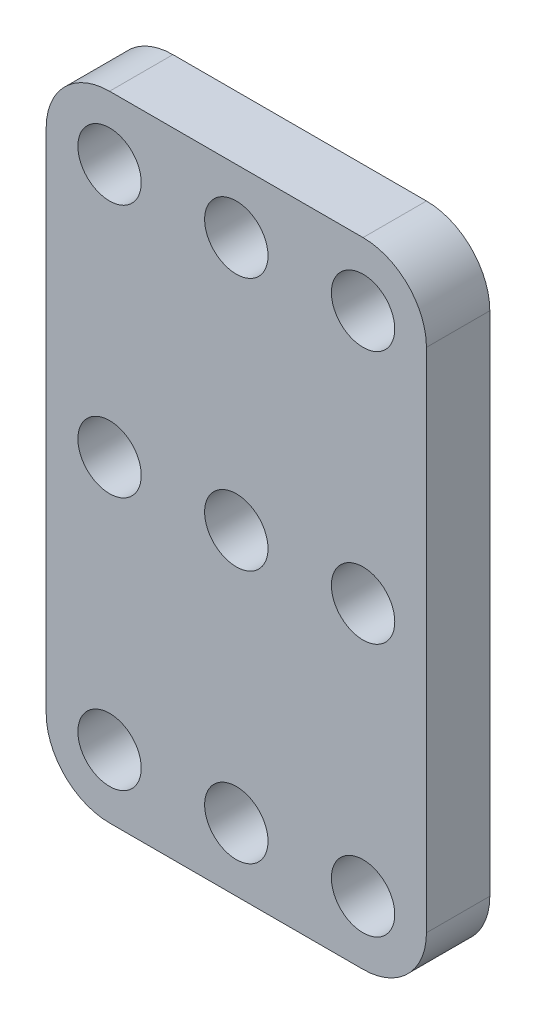
ISO-10303-21;
HEADER;
FILE_DESCRIPTION(('STEP AP214'),'2;1');
FILE_NAME('part.step','',(''),(''),'','','');
FILE_SCHEMA(('AUTOMOTIVE_DESIGN { 1 0 10303 214 1 1 1 1 }'));
ENDSEC;
DATA;
#1=APPLICATION_CONTEXT('core data for automotive mechanical design processes');
#2=APPLICATION_PROTOCOL_DEFINITION('international standard','automotive_design',2000,#1);
#3=PRODUCT_CONTEXT('',#1,'mechanical');
#4=PRODUCT('Part','Part','',(#3));
#5=PRODUCT_RELATED_PRODUCT_CATEGORY('part','',(#4));
#6=PRODUCT_DEFINITION_FORMATION('','',#4);
#7=PRODUCT_DEFINITION_CONTEXT('part definition',#1,'design');
#8=PRODUCT_DEFINITION('design','',#6,#7);
#9=PRODUCT_DEFINITION_SHAPE('','',#8);
#10=(LENGTH_UNIT() NAMED_UNIT(*) SI_UNIT(.MILLI.,.METRE.));
#11=(NAMED_UNIT(*) PLANE_ANGLE_UNIT() SI_UNIT($,.RADIAN.));
#12=(NAMED_UNIT(*) SI_UNIT($,.STERADIAN.) SOLID_ANGLE_UNIT());
#13=UNCERTAINTY_MEASURE_WITH_UNIT(LENGTH_MEASURE(1.E-05),#10,'distance_accuracy_value','');
#14=(GEOMETRIC_REPRESENTATION_CONTEXT(3) GLOBAL_UNCERTAINTY_ASSIGNED_CONTEXT((#13)) GLOBAL_UNIT_ASSIGNED_CONTEXT((#10,
#11,#12)) REPRESENTATION_CONTEXT('',''));
#15=CARTESIAN_POINT('',(0.,0.,0.));
#16=DIRECTION('',(0.,0.,1.));
#17=DIRECTION('',(1.,0.,0.));
#18=AXIS2_PLACEMENT_3D('',#15,#16,#17);
#19=CARTESIAN_POINT('',(0.,0.,5.));
#20=DIRECTION('',(0.,0.,1.));
#21=DIRECTION('',(1.,0.,0.));
#22=AXIS2_PLACEMENT_3D('',#19,#20,#21);
#23=PLANE('',#22);
#24=CARTESIAN_POINT('',(-59.0962956082063,-2.16672203765227,5.));
#25=DIRECTION('',(0.,0.,1.));
#26=DIRECTION('',(1.,0.,0.));
#27=AXIS2_PLACEMENT_3D('',#24,#25,#26);
#28=CIRCLE('',#27,2.5);
#29=CARTESIAN_POINT('',(-56.5962956082063,-2.16672203765227,5.));
#30=VERTEX_POINT('',#29);
#31=EDGE_CURVE('E213',#30,#30,#28,.T.);
#32=ORIENTED_EDGE('',*,*,#31,.F.);
#33=EDGE_LOOP('',(#32));
#34=FACE_BOUND('',#33,.T.);
#35=CARTESIAN_POINT('',(-49.0962956082061,-22.1667220376523,5.));
#36=DIRECTION('',(0.,0.,1.));
#37=DIRECTION('',(1.,0.,0.));
#38=AXIS2_PLACEMENT_3D('',#35,#36,#37);
#39=CIRCLE('',#38,2.5);
#40=CARTESIAN_POINT('',(-46.5962956082061,-22.1667220376523,5.));
#41=VERTEX_POINT('',#40);
#42=EDGE_CURVE('E201',#41,#41,#39,.T.);
#43=ORIENTED_EDGE('',*,*,#42,.F.);
#44=EDGE_LOOP('',(#43));
#45=FACE_BOUND('',#44,.T.);
#46=CARTESIAN_POINT('',(-49.0962956082063,-2.16672203765227,5.));
#47=DIRECTION('',(0.,0.,1.));
#48=DIRECTION('',(1.,0.,0.));
#49=AXIS2_PLACEMENT_3D('',#46,#47,#48);
#50=CIRCLE('',#49,2.5);
#51=CARTESIAN_POINT('',(-46.5962956082063,-2.16672203765227,5.));
#52=VERTEX_POINT('',#51);
#53=EDGE_CURVE('E189',#52,#52,#50,.T.);
#54=ORIENTED_EDGE('',*,*,#53,.F.);
#55=EDGE_LOOP('',(#54));
#56=FACE_BOUND('',#55,.T.);
#57=CARTESIAN_POINT('',(-49.0962956082065,17.8332779623477,5.));
#58=DIRECTION('',(0.,0.,1.));
#59=DIRECTION('',(1.,0.,0.));
#60=AXIS2_PLACEMENT_3D('',#57,#58,#59);
#61=CIRCLE('',#60,2.5);
#62=CARTESIAN_POINT('',(-46.5962956082065,17.8332779623477,5.));
#63=VERTEX_POINT('',#62);
#64=EDGE_CURVE('E178',#63,#63,#61,.T.);
#65=ORIENTED_EDGE('',*,*,#64,.F.);
#66=EDGE_LOOP('',(#65));
#67=FACE_BOUND('',#66,.T.);
#68=DIRECTION('',(-1.,0.,0.));
#69=VECTOR('',#68,1.);
#70=CARTESIAN_POINT('',(-64.0962956082065,22.8332779623477,5.));
#71=LINE('',#70,#69);
#72=CARTESIAN_POINT('',(-39.0962956082065,22.8332779623477,5.));
#73=VERTEX_POINT('',#72);
#74=CARTESIAN_POINT('',(-59.0962956082065,22.8332779623477,5.));
#75=VERTEX_POINT('',#74);
#76=EDGE_CURVE('E134',#73,#75,#71,.T.);
#77=ORIENTED_EDGE('',*,*,#76,.T.);
#78=CARTESIAN_POINT('',(-59.0962956082065,17.8332779623477,5.));
#79=DIRECTION('',(0.,0.,1.));
#80=DIRECTION('',(1.,0.,0.));
#81=AXIS2_PLACEMENT_3D('',#78,#79,#80);
#82=CIRCLE('',#81,5.);
#83=CARTESIAN_POINT('',(-64.0962956082065,17.8332779623477,5.));
#84=VERTEX_POINT('',#83);
#85=EDGE_CURVE('E153',#75,#84,#82,.T.);
#86=ORIENTED_EDGE('',*,*,#85,.T.);
#87=DIRECTION('',(0.,-1.,0.));
#88=VECTOR('',#87,1.);
#89=CARTESIAN_POINT('',(-64.0962956082065,22.8332779623477,5.));
#90=LINE('',#89,#88);
#91=CARTESIAN_POINT('',(-64.0962956082065,-22.1667220376523,5.));
#92=VERTEX_POINT('',#91);
#93=EDGE_CURVE('E117',#84,#92,#90,.T.);
#94=ORIENTED_EDGE('',*,*,#93,.T.);
#95=CARTESIAN_POINT('',(-59.0962956082065,-22.1667220376523,5.));
#96=DIRECTION('',(0.,0.,1.));
#97=DIRECTION('',(1.,0.,0.));
#98=AXIS2_PLACEMENT_3D('',#95,#96,#97);
#99=CIRCLE('',#98,5.);
#100=CARTESIAN_POINT('',(-59.0962956082065,-27.1667220376523,5.));
#101=VERTEX_POINT('',#100);
#102=EDGE_CURVE('E151',#92,#101,#99,.T.);
#103=ORIENTED_EDGE('',*,*,#102,.T.);
#104=DIRECTION('',(1.,0.,0.));
#105=VECTOR('',#104,1.);
#106=CARTESIAN_POINT('',(-64.0962956082065,-27.1667220376523,5.));
#107=LINE('',#106,#105);
#108=CARTESIAN_POINT('',(-39.0962956082065,-27.1667220376523,5.));
#109=VERTEX_POINT('',#108);
#110=EDGE_CURVE('E173',#101,#109,#107,.T.);
#111=ORIENTED_EDGE('',*,*,#110,.T.);
#112=CARTESIAN_POINT('',(-39.0962956082065,-22.1667220376523,5.));
#113=DIRECTION('',(0.,0.,1.));
#114=DIRECTION('',(1.,0.,0.));
#115=AXIS2_PLACEMENT_3D('',#112,#113,#114);
#116=CIRCLE('',#115,5.);
#117=CARTESIAN_POINT('',(-34.0962956082065,-22.1667220376523,5.));
#118=VERTEX_POINT('',#117);
#119=EDGE_CURVE('E52',#109,#118,#116,.T.);
#120=ORIENTED_EDGE('',*,*,#119,.T.);
#121=DIRECTION('',(0.,1.,0.));
#122=VECTOR('',#121,1.);
#123=CARTESIAN_POINT('',(-34.0962956082065,22.8332779623477,5.));
#124=LINE('',#123,#122);
#125=CARTESIAN_POINT('',(-34.0962956082065,17.8332779623477,5.));
#126=VERTEX_POINT('',#125);
#127=EDGE_CURVE('E163',#118,#126,#124,.T.);
#128=ORIENTED_EDGE('',*,*,#127,.T.);
#129=CARTESIAN_POINT('',(-39.0962956082065,17.8332779623477,5.));
#130=DIRECTION('',(0.,0.,1.));
#131=DIRECTION('',(1.,0.,0.));
#132=AXIS2_PLACEMENT_3D('',#129,#130,#131);
#133=CIRCLE('',#132,5.);
#134=EDGE_CURVE('E149',#126,#73,#133,.T.);
#135=ORIENTED_EDGE('',*,*,#134,.T.);
#136=EDGE_LOOP('',(#77,#86,#94,#103,#111,#120,#128,#135));
#137=FACE_BOUND('',#136,.T.);
#138=CARTESIAN_POINT('',(-59.0962956082065,17.8332779623477,5.));
#139=DIRECTION('',(0.,0.,1.));
#140=DIRECTION('',(1.,0.,0.));
#141=AXIS2_PLACEMENT_3D('',#138,#139,#140);
#142=CIRCLE('',#141,2.5);
#143=CARTESIAN_POINT('',(-56.5962956082065,17.8332779623477,5.));
#144=VERTEX_POINT('',#143);
#145=EDGE_CURVE('E125',#144,#144,#142,.T.);
#146=ORIENTED_EDGE('',*,*,#145,.F.);
#147=EDGE_LOOP('',(#146));
#148=FACE_BOUND('',#147,.T.);
#149=CARTESIAN_POINT('',(-39.0962956082065,17.8332779623477,5.));
#150=DIRECTION('',(0.,0.,1.));
#151=DIRECTION('',(1.,0.,0.));
#152=AXIS2_PLACEMENT_3D('',#149,#150,#151);
#153=CIRCLE('',#152,2.50000000000001);
#154=CARTESIAN_POINT('',(-36.5962956082065,17.8332779623477,5.));
#155=VERTEX_POINT('',#154);
#156=EDGE_CURVE('E183',#155,#155,#153,.T.);
#157=ORIENTED_EDGE('',*,*,#156,.F.);
#158=EDGE_LOOP('',(#157));
#159=FACE_BOUND('',#158,.T.);
#160=CARTESIAN_POINT('',(-39.0962956082063,-2.16672203765227,5.));
#161=DIRECTION('',(0.,0.,1.));
#162=DIRECTION('',(1.,0.,0.));
#163=AXIS2_PLACEMENT_3D('',#160,#161,#162);
#164=CIRCLE('',#163,2.50000000000001);
#165=CARTESIAN_POINT('',(-36.5962956082063,-2.16672203765227,5.));
#166=VERTEX_POINT('',#165);
#167=EDGE_CURVE('E195',#166,#166,#164,.T.);
#168=ORIENTED_EDGE('',*,*,#167,.F.);
#169=EDGE_LOOP('',(#168));
#170=FACE_BOUND('',#169,.T.);
#171=CARTESIAN_POINT('',(-39.0962956082061,-22.1667220376523,5.));
#172=DIRECTION('',(0.,0.,1.));
#173=DIRECTION('',(1.,0.,0.));
#174=AXIS2_PLACEMENT_3D('',#171,#172,#173);
#175=CIRCLE('',#174,2.5);
#176=CARTESIAN_POINT('',(-36.5962956082061,-22.1667220376523,5.));
#177=VERTEX_POINT('',#176);
#178=EDGE_CURVE('E207',#177,#177,#175,.T.);
#179=ORIENTED_EDGE('',*,*,#178,.F.);
#180=EDGE_LOOP('',(#179));
#181=FACE_BOUND('',#180,.T.);
#182=CARTESIAN_POINT('',(-59.0962956082061,-22.1667220376523,5.));
#183=DIRECTION('',(0.,0.,1.));
#184=DIRECTION('',(1.,0.,0.));
#185=AXIS2_PLACEMENT_3D('',#182,#183,#184);
#186=CIRCLE('',#185,2.5);
#187=CARTESIAN_POINT('',(-56.5962956082061,-22.1667220376523,5.));
#188=VERTEX_POINT('',#187);
#189=EDGE_CURVE('E219',#188,#188,#186,.T.);
#190=ORIENTED_EDGE('',*,*,#189,.F.);
#191=EDGE_LOOP('',(#190));
#192=FACE_BOUND('',#191,.T.);
#193=ADVANCED_FACE('F32',(#34,#45,#56,#67,#137,#148,#159,#170,#181,#192),#23,.T.);
#194=CARTESIAN_POINT('',(0.,0.,0.));
#195=DIRECTION('',(0.,0.,1.));
#196=DIRECTION('',(1.,0.,0.));
#197=AXIS2_PLACEMENT_3D('',#194,#195,#196);
#198=PLANE('',#197);
#199=CARTESIAN_POINT('',(-59.0962956082063,-2.16672203765227,0.));
#200=DIRECTION('',(0.,0.,1.));
#201=DIRECTION('',(1.,0.,0.));
#202=AXIS2_PLACEMENT_3D('',#199,#200,#201);
#203=CIRCLE('',#202,2.5);
#204=CARTESIAN_POINT('',(-56.5962956082063,-2.16672203765227,0.));
#205=VERTEX_POINT('',#204);
#206=EDGE_CURVE('E216',#205,#205,#203,.T.);
#207=ORIENTED_EDGE('',*,*,#206,.T.);
#208=EDGE_LOOP('',(#207));
#209=FACE_BOUND('',#208,.T.);
#210=CARTESIAN_POINT('',(-49.0962956082061,-22.1667220376523,0.));
#211=DIRECTION('',(0.,0.,1.));
#212=DIRECTION('',(1.,0.,0.));
#213=AXIS2_PLACEMENT_3D('',#210,#211,#212);
#214=CIRCLE('',#213,2.5);
#215=CARTESIAN_POINT('',(-46.5962956082061,-22.1667220376523,0.));
#216=VERTEX_POINT('',#215);
#217=EDGE_CURVE('E204',#216,#216,#214,.T.);
#218=ORIENTED_EDGE('',*,*,#217,.T.);
#219=EDGE_LOOP('',(#218));
#220=FACE_BOUND('',#219,.T.);
#221=CARTESIAN_POINT('',(-49.0962956082063,-2.16672203765227,0.));
#222=DIRECTION('',(0.,0.,1.));
#223=DIRECTION('',(1.,0.,0.));
#224=AXIS2_PLACEMENT_3D('',#221,#222,#223);
#225=CIRCLE('',#224,2.5);
#226=CARTESIAN_POINT('',(-46.5962956082063,-2.16672203765227,0.));
#227=VERTEX_POINT('',#226);
#228=EDGE_CURVE('E192',#227,#227,#225,.T.);
#229=ORIENTED_EDGE('',*,*,#228,.T.);
#230=EDGE_LOOP('',(#229));
#231=FACE_BOUND('',#230,.T.);
#232=CARTESIAN_POINT('',(-49.0962956082065,17.8332779623477,0.));
#233=DIRECTION('',(0.,0.,1.));
#234=DIRECTION('',(1.,0.,0.));
#235=AXIS2_PLACEMENT_3D('',#232,#233,#234);
#236=CIRCLE('',#235,2.5);
#237=CARTESIAN_POINT('',(-46.5962956082065,17.8332779623477,0.));
#238=VERTEX_POINT('',#237);
#239=EDGE_CURVE('E180',#238,#238,#236,.T.);
#240=ORIENTED_EDGE('',*,*,#239,.T.);
#241=EDGE_LOOP('',(#240));
#242=FACE_BOUND('',#241,.T.);
#243=DIRECTION('',(0.,-1.,0.));
#244=VECTOR('',#243,1.);
#245=CARTESIAN_POINT('',(-64.0962956082065,22.8332779623477,0.));
#246=LINE('',#245,#244);
#247=CARTESIAN_POINT('',(-64.0962956082065,17.8332779623477,0.));
#248=VERTEX_POINT('',#247);
#249=CARTESIAN_POINT('',(-64.0962956082065,-22.1667220376523,0.));
#250=VERTEX_POINT('',#249);
#251=EDGE_CURVE('E114',#248,#250,#246,.T.);
#252=ORIENTED_EDGE('',*,*,#251,.F.);
#253=CARTESIAN_POINT('',(-59.0962956082065,17.8332779623477,0.));
#254=DIRECTION('',(0.,0.,1.));
#255=DIRECTION('',(1.,0.,0.));
#256=AXIS2_PLACEMENT_3D('',#253,#254,#255);
#257=CIRCLE('',#256,5.);
#258=CARTESIAN_POINT('',(-59.0962956082065,22.8332779623477,0.));
#259=VERTEX_POINT('',#258);
#260=EDGE_CURVE('E97',#248,#259,#257,.F.);
#261=ORIENTED_EDGE('',*,*,#260,.T.);
#262=DIRECTION('',(-1.,0.,0.));
#263=VECTOR('',#262,1.);
#264=CARTESIAN_POINT('',(-64.0962956082065,22.8332779623477,0.));
#265=LINE('',#264,#263);
#266=CARTESIAN_POINT('',(-39.0962956082065,22.8332779623477,0.));
#267=VERTEX_POINT('',#266);
#268=EDGE_CURVE('E138',#267,#259,#265,.T.);
#269=ORIENTED_EDGE('',*,*,#268,.F.);
#270=CARTESIAN_POINT('',(-39.0962956082065,17.8332779623477,0.));
#271=DIRECTION('',(0.,0.,1.));
#272=DIRECTION('',(1.,0.,0.));
#273=AXIS2_PLACEMENT_3D('',#270,#271,#272);
#274=CIRCLE('',#273,5.);
#275=CARTESIAN_POINT('',(-34.0962956082065,17.8332779623477,0.));
#276=VERTEX_POINT('',#275);
#277=EDGE_CURVE('E142',#267,#276,#274,.F.);
#278=ORIENTED_EDGE('',*,*,#277,.T.);
#279=DIRECTION('',(0.,1.,0.));
#280=VECTOR('',#279,1.);
#281=CARTESIAN_POINT('',(-34.0962956082065,22.8332779623477,0.));
#282=LINE('',#281,#280);
#283=CARTESIAN_POINT('',(-34.0962956082065,-22.1667220376523,0.));
#284=VERTEX_POINT('',#283);
#285=EDGE_CURVE('E128',#284,#276,#282,.T.);
#286=ORIENTED_EDGE('',*,*,#285,.F.);
#287=CARTESIAN_POINT('',(-39.0962956082065,-22.1667220376523,0.));
#288=DIRECTION('',(0.,0.,1.));
#289=DIRECTION('',(1.,0.,0.));
#290=AXIS2_PLACEMENT_3D('',#287,#288,#289);
#291=CIRCLE('',#290,5.);
#292=CARTESIAN_POINT('',(-39.0962956082065,-27.1667220376523,0.));
#293=VERTEX_POINT('',#292);
#294=EDGE_CURVE('E118',#284,#293,#291,.F.);
#295=ORIENTED_EDGE('',*,*,#294,.T.);
#296=DIRECTION('',(1.,0.,0.));
#297=VECTOR('',#296,1.);
#298=CARTESIAN_POINT('',(-64.0962956082065,-27.1667220376523,0.));
#299=LINE('',#298,#297);
#300=CARTESIAN_POINT('',(-59.0962956082065,-27.1667220376523,0.));
#301=VERTEX_POINT('',#300);
#302=EDGE_CURVE('E124',#301,#293,#299,.T.);
#303=ORIENTED_EDGE('',*,*,#302,.F.);
#304=CARTESIAN_POINT('',(-59.0962956082065,-22.1667220376523,0.));
#305=DIRECTION('',(0.,0.,1.));
#306=DIRECTION('',(1.,0.,0.));
#307=AXIS2_PLACEMENT_3D('',#304,#305,#306);
#308=CIRCLE('',#307,5.);
#309=EDGE_CURVE('E108',#301,#250,#308,.F.);
#310=ORIENTED_EDGE('',*,*,#309,.T.);
#311=EDGE_LOOP('',(#252,#261,#269,#278,#286,#295,#303,#310));
#312=FACE_BOUND('',#311,.T.);
#313=CARTESIAN_POINT('',(-59.0962956082065,17.8332779623477,0.));
#314=DIRECTION('',(0.,0.,1.));
#315=DIRECTION('',(1.,0.,0.));
#316=AXIS2_PLACEMENT_3D('',#313,#314,#315);
#317=CIRCLE('',#316,2.5);
#318=CARTESIAN_POINT('',(-56.5962956082065,17.8332779623477,0.));
#319=VERTEX_POINT('',#318);
#320=EDGE_CURVE('E131',#319,#319,#317,.T.);
#321=ORIENTED_EDGE('',*,*,#320,.T.);
#322=EDGE_LOOP('',(#321));
#323=FACE_BOUND('',#322,.T.);
#324=CARTESIAN_POINT('',(-39.0962956082065,17.8332779623477,0.));
#325=DIRECTION('',(0.,0.,1.));
#326=DIRECTION('',(1.,0.,0.));
#327=AXIS2_PLACEMENT_3D('',#324,#325,#326);
#328=CIRCLE('',#327,2.50000000000001);
#329=CARTESIAN_POINT('',(-36.5962956082065,17.8332779623477,0.));
#330=VERTEX_POINT('',#329);
#331=EDGE_CURVE('E186',#330,#330,#328,.T.);
#332=ORIENTED_EDGE('',*,*,#331,.T.);
#333=EDGE_LOOP('',(#332));
#334=FACE_BOUND('',#333,.T.);
#335=CARTESIAN_POINT('',(-39.0962956082063,-2.16672203765227,0.));
#336=DIRECTION('',(0.,0.,1.));
#337=DIRECTION('',(1.,0.,0.));
#338=AXIS2_PLACEMENT_3D('',#335,#336,#337);
#339=CIRCLE('',#338,2.50000000000001);
#340=CARTESIAN_POINT('',(-36.5962956082063,-2.16672203765227,0.));
#341=VERTEX_POINT('',#340);
#342=EDGE_CURVE('E198',#341,#341,#339,.T.);
#343=ORIENTED_EDGE('',*,*,#342,.T.);
#344=EDGE_LOOP('',(#343));
#345=FACE_BOUND('',#344,.T.);
#346=CARTESIAN_POINT('',(-39.0962956082061,-22.1667220376523,0.));
#347=DIRECTION('',(0.,0.,1.));
#348=DIRECTION('',(1.,0.,0.));
#349=AXIS2_PLACEMENT_3D('',#346,#347,#348);
#350=CIRCLE('',#349,2.5);
#351=CARTESIAN_POINT('',(-36.5962956082061,-22.1667220376523,0.));
#352=VERTEX_POINT('',#351);
#353=EDGE_CURVE('E210',#352,#352,#350,.T.);
#354=ORIENTED_EDGE('',*,*,#353,.T.);
#355=EDGE_LOOP('',(#354));
#356=FACE_BOUND('',#355,.T.);
#357=CARTESIAN_POINT('',(-59.0962956082061,-22.1667220376523,0.));
#358=DIRECTION('',(0.,0.,1.));
#359=DIRECTION('',(1.,0.,0.));
#360=AXIS2_PLACEMENT_3D('',#357,#358,#359);
#361=CIRCLE('',#360,2.5);
#362=CARTESIAN_POINT('',(-56.5962956082061,-22.1667220376523,0.));
#363=VERTEX_POINT('',#362);
#364=EDGE_CURVE('E222',#363,#363,#361,.T.);
#365=ORIENTED_EDGE('',*,*,#364,.T.);
#366=EDGE_LOOP('',(#365));
#367=FACE_BOUND('',#366,.T.);
#368=ADVANCED_FACE('F121',(#209,#220,#231,#242,#312,#323,#334,#345,#356,#367),#198,.F.);
#369=CARTESIAN_POINT('',(-64.0962956082065,22.8332779623477,5.));
#370=DIRECTION('',(1.,0.,0.));
#371=DIRECTION('',(0.,0.,-1.));
#372=AXIS2_PLACEMENT_3D('',#369,#370,#371);
#373=PLANE('',#372);
#374=ORIENTED_EDGE('',*,*,#93,.F.);
#375=DIRECTION('',(0.,0.,-1.));
#376=VECTOR('',#375,1.);
#377=CARTESIAN_POINT('',(-64.0962956082065,17.8332779623477,5.));
#378=LINE('',#377,#376);
#379=EDGE_CURVE('E101',#84,#248,#378,.T.);
#380=ORIENTED_EDGE('',*,*,#379,.T.);
#381=ORIENTED_EDGE('',*,*,#251,.T.);
#382=DIRECTION('',(0.,0.,-1.));
#383=VECTOR('',#382,1.);
#384=CARTESIAN_POINT('',(-64.0962956082065,-22.1667220376523,5.));
#385=LINE('',#384,#383);
#386=EDGE_CURVE('E119',#250,#92,#385,.F.);
#387=ORIENTED_EDGE('',*,*,#386,.T.);
#388=EDGE_LOOP('',(#374,#380,#381,#387));
#389=FACE_BOUND('',#388,.T.);
#390=ADVANCED_FACE('F113',(#389),#373,.F.);
#391=CARTESIAN_POINT('',(-64.0962956082065,-27.1667220376523,5.));
#392=DIRECTION('',(0.,1.,0.));
#393=DIRECTION('',(0.,0.,1.));
#394=AXIS2_PLACEMENT_3D('',#391,#392,#393);
#395=PLANE('',#394);
#396=ORIENTED_EDGE('',*,*,#110,.F.);
#397=DIRECTION('',(0.,0.,-1.));
#398=VECTOR('',#397,1.);
#399=CARTESIAN_POINT('',(-59.0962956082065,-27.1667220376523,5.));
#400=LINE('',#399,#398);
#401=EDGE_CURVE('E157',#101,#301,#400,.T.);
#402=ORIENTED_EDGE('',*,*,#401,.T.);
#403=ORIENTED_EDGE('',*,*,#302,.T.);
#404=DIRECTION('',(0.,0.,-1.));
#405=VECTOR('',#404,1.);
#406=CARTESIAN_POINT('',(-39.0962956082065,-27.1667220376523,5.));
#407=LINE('',#406,#405);
#408=EDGE_CURVE('E155',#293,#109,#407,.F.);
#409=ORIENTED_EDGE('',*,*,#408,.T.);
#410=EDGE_LOOP('',(#396,#402,#403,#409));
#411=FACE_BOUND('',#410,.T.);
#412=ADVANCED_FACE('F249',(#411),#395,.F.);
#413=CARTESIAN_POINT('',(-34.0962956082065,22.8332779623477,5.));
#414=DIRECTION('',(-1.,0.,0.));
#415=DIRECTION('',(0.,-1.,0.));
#416=AXIS2_PLACEMENT_3D('',#413,#414,#415);
#417=PLANE('',#416);
#418=ORIENTED_EDGE('',*,*,#285,.T.);
#419=DIRECTION('',(0.,0.,-1.));
#420=VECTOR('',#419,1.);
#421=CARTESIAN_POINT('',(-34.0962956082065,17.8332779623477,5.));
#422=LINE('',#421,#420);
#423=EDGE_CURVE('E11',#276,#126,#422,.F.);
#424=ORIENTED_EDGE('',*,*,#423,.T.);
#425=ORIENTED_EDGE('',*,*,#127,.F.);
#426=DIRECTION('',(0.,0.,-1.));
#427=VECTOR('',#426,1.);
#428=CARTESIAN_POINT('',(-34.0962956082065,-22.1667220376523,5.));
#429=LINE('',#428,#427);
#430=EDGE_CURVE('E40',#118,#284,#429,.T.);
#431=ORIENTED_EDGE('',*,*,#430,.T.);
#432=EDGE_LOOP('',(#418,#424,#425,#431));
#433=FACE_BOUND('',#432,.T.);
#434=ADVANCED_FACE('F162',(#433),#417,.F.);
#435=CARTESIAN_POINT('',(-64.0962956082065,22.8332779623477,5.));
#436=DIRECTION('',(0.,-1.,0.));
#437=DIRECTION('',(0.,0.,-1.));
#438=AXIS2_PLACEMENT_3D('',#435,#436,#437);
#439=PLANE('',#438);
#440=ORIENTED_EDGE('',*,*,#268,.T.);
#441=DIRECTION('',(0.,0.,-1.));
#442=VECTOR('',#441,1.);
#443=CARTESIAN_POINT('',(-59.0962956082065,22.8332779623477,5.));
#444=LINE('',#443,#442);
#445=EDGE_CURVE('E102',#259,#75,#444,.F.);
#446=ORIENTED_EDGE('',*,*,#445,.T.);
#447=ORIENTED_EDGE('',*,*,#76,.F.);
#448=DIRECTION('',(0.,0.,-1.));
#449=VECTOR('',#448,1.);
#450=CARTESIAN_POINT('',(-39.0962956082065,22.8332779623477,5.));
#451=LINE('',#450,#449);
#452=EDGE_CURVE('E107',#73,#267,#451,.T.);
#453=ORIENTED_EDGE('',*,*,#452,.T.);
#454=EDGE_LOOP('',(#440,#446,#447,#453));
#455=FACE_BOUND('',#454,.T.);
#456=ADVANCED_FACE('F171',(#455),#439,.F.);
#457=CARTESIAN_POINT('',(-59.0962956082065,17.8332779623477,5.));
#458=DIRECTION('',(0.,0.,-1.));
#459=DIRECTION('',(-1.,0.,0.));
#460=AXIS2_PLACEMENT_3D('',#457,#458,#459);
#461=CYLINDRICAL_SURFACE('',#460,2.5);
#462=ORIENTED_EDGE('',*,*,#145,.T.);
#463=EDGE_LOOP('',(#462));
#464=FACE_BOUND('',#463,.T.);
#465=ORIENTED_EDGE('',*,*,#320,.F.);
#466=EDGE_LOOP('',(#465));
#467=FACE_BOUND('',#466,.T.);
#468=ADVANCED_FACE('F242',(#464,#467),#461,.F.);
#469=CARTESIAN_POINT('',(-49.0962956082065,17.8332779623477,5.));
#470=DIRECTION('',(0.,0.,-1.));
#471=DIRECTION('',(-1.,0.,0.));
#472=AXIS2_PLACEMENT_3D('',#469,#470,#471);
#473=CYLINDRICAL_SURFACE('',#472,2.5);
#474=ORIENTED_EDGE('',*,*,#64,.T.);
#475=EDGE_LOOP('',(#474));
#476=FACE_BOUND('',#475,.T.);
#477=ORIENTED_EDGE('',*,*,#239,.F.);
#478=EDGE_LOOP('',(#477));
#479=FACE_BOUND('',#478,.T.);
#480=ADVANCED_FACE('F310',(#476,#479),#473,.F.);
#481=CARTESIAN_POINT('',(-39.0962956082065,17.8332779623477,5.));
#482=DIRECTION('',(0.,0.,-1.));
#483=DIRECTION('',(-1.,0.,0.));
#484=AXIS2_PLACEMENT_3D('',#481,#482,#483);
#485=CYLINDRICAL_SURFACE('',#484,2.50000000000001);
#486=ORIENTED_EDGE('',*,*,#156,.T.);
#487=EDGE_LOOP('',(#486));
#488=FACE_BOUND('',#487,.T.);
#489=ORIENTED_EDGE('',*,*,#331,.F.);
#490=EDGE_LOOP('',(#489));
#491=FACE_BOUND('',#490,.T.);
#492=ADVANCED_FACE('F307',(#488,#491),#485,.F.);
#493=CARTESIAN_POINT('',(-49.0962956082063,-2.16672203765227,5.));
#494=DIRECTION('',(0.,0.,-1.));
#495=DIRECTION('',(-1.,0.,0.));
#496=AXIS2_PLACEMENT_3D('',#493,#494,#495);
#497=CYLINDRICAL_SURFACE('',#496,2.5);
#498=ORIENTED_EDGE('',*,*,#53,.T.);
#499=EDGE_LOOP('',(#498));
#500=FACE_BOUND('',#499,.T.);
#501=ORIENTED_EDGE('',*,*,#228,.F.);
#502=EDGE_LOOP('',(#501));
#503=FACE_BOUND('',#502,.T.);
#504=ADVANCED_FACE('F303',(#500,#503),#497,.F.);
#505=CARTESIAN_POINT('',(-39.0962956082063,-2.16672203765227,5.));
#506=DIRECTION('',(0.,0.,-1.));
#507=DIRECTION('',(-1.,0.,0.));
#508=AXIS2_PLACEMENT_3D('',#505,#506,#507);
#509=CYLINDRICAL_SURFACE('',#508,2.50000000000001);
#510=ORIENTED_EDGE('',*,*,#167,.T.);
#511=EDGE_LOOP('',(#510));
#512=FACE_BOUND('',#511,.T.);
#513=ORIENTED_EDGE('',*,*,#342,.F.);
#514=EDGE_LOOP('',(#513));
#515=FACE_BOUND('',#514,.T.);
#516=ADVANCED_FACE('F299',(#512,#515),#509,.F.);
#517=CARTESIAN_POINT('',(-49.0962956082061,-22.1667220376523,5.));
#518=DIRECTION('',(0.,0.,-1.));
#519=DIRECTION('',(-1.,0.,0.));
#520=AXIS2_PLACEMENT_3D('',#517,#518,#519);
#521=CYLINDRICAL_SURFACE('',#520,2.5);
#522=ORIENTED_EDGE('',*,*,#42,.T.);
#523=EDGE_LOOP('',(#522));
#524=FACE_BOUND('',#523,.T.);
#525=ORIENTED_EDGE('',*,*,#217,.F.);
#526=EDGE_LOOP('',(#525));
#527=FACE_BOUND('',#526,.T.);
#528=ADVANCED_FACE('F283',(#524,#527),#521,.F.);
#529=CARTESIAN_POINT('',(-39.0962956082061,-22.1667220376523,5.));
#530=DIRECTION('',(0.,0.,-1.));
#531=DIRECTION('',(-1.,0.,0.));
#532=AXIS2_PLACEMENT_3D('',#529,#530,#531);
#533=CYLINDRICAL_SURFACE('',#532,2.5);
#534=ORIENTED_EDGE('',*,*,#178,.T.);
#535=EDGE_LOOP('',(#534));
#536=FACE_BOUND('',#535,.T.);
#537=ORIENTED_EDGE('',*,*,#353,.F.);
#538=EDGE_LOOP('',(#537));
#539=FACE_BOUND('',#538,.T.);
#540=ADVANCED_FACE('F279',(#536,#539),#533,.F.);
#541=CARTESIAN_POINT('',(-59.0962956082063,-2.16672203765227,5.));
#542=DIRECTION('',(0.,0.,-1.));
#543=DIRECTION('',(-1.,0.,0.));
#544=AXIS2_PLACEMENT_3D('',#541,#542,#543);
#545=CYLINDRICAL_SURFACE('',#544,2.5);
#546=ORIENTED_EDGE('',*,*,#31,.T.);
#547=EDGE_LOOP('',(#546));
#548=FACE_BOUND('',#547,.T.);
#549=ORIENTED_EDGE('',*,*,#206,.F.);
#550=EDGE_LOOP('',(#549));
#551=FACE_BOUND('',#550,.T.);
#552=ADVANCED_FACE('F282',(#548,#551),#545,.F.);
#553=CARTESIAN_POINT('',(-59.0962956082061,-22.1667220376523,5.));
#554=DIRECTION('',(0.,0.,-1.));
#555=DIRECTION('',(-1.,0.,0.));
#556=AXIS2_PLACEMENT_3D('',#553,#554,#555);
#557=CYLINDRICAL_SURFACE('',#556,2.5);
#558=ORIENTED_EDGE('',*,*,#189,.T.);
#559=EDGE_LOOP('',(#558));
#560=FACE_BOUND('',#559,.T.);
#561=ORIENTED_EDGE('',*,*,#364,.F.);
#562=EDGE_LOOP('',(#561));
#563=FACE_BOUND('',#562,.T.);
#564=ADVANCED_FACE('F228',(#560,#563),#557,.F.);
#565=CARTESIAN_POINT('',(-59.0962956082065,17.8332779623477,5.));
#566=DIRECTION('',(0.,0.,-1.));
#567=DIRECTION('',(-1.,0.,0.));
#568=AXIS2_PLACEMENT_3D('',#565,#566,#567);
#569=CYLINDRICAL_SURFACE('',#568,5.);
#570=ORIENTED_EDGE('',*,*,#85,.F.);
#571=ORIENTED_EDGE('',*,*,#445,.F.);
#572=ORIENTED_EDGE('',*,*,#260,.F.);
#573=ORIENTED_EDGE('',*,*,#379,.F.);
#574=EDGE_LOOP('',(#570,#571,#572,#573));
#575=FACE_BOUND('',#574,.T.);
#576=ADVANCED_FACE('F100',(#575),#569,.T.);
#577=CARTESIAN_POINT('',(-59.0962956082065,-22.1667220376523,5.));
#578=DIRECTION('',(0.,0.,-1.));
#579=DIRECTION('',(-1.,0.,0.));
#580=AXIS2_PLACEMENT_3D('',#577,#578,#579);
#581=CYLINDRICAL_SURFACE('',#580,5.);
#582=ORIENTED_EDGE('',*,*,#102,.F.);
#583=ORIENTED_EDGE('',*,*,#386,.F.);
#584=ORIENTED_EDGE('',*,*,#309,.F.);
#585=ORIENTED_EDGE('',*,*,#401,.F.);
#586=EDGE_LOOP('',(#582,#583,#584,#585));
#587=FACE_BOUND('',#586,.T.);
#588=ADVANCED_FACE('F257',(#587),#581,.T.);
#589=CARTESIAN_POINT('',(-39.0962956082065,17.8332779623477,5.));
#590=DIRECTION('',(0.,0.,-1.));
#591=DIRECTION('',(-1.,0.,0.));
#592=AXIS2_PLACEMENT_3D('',#589,#590,#591);
#593=CYLINDRICAL_SURFACE('',#592,5.);
#594=ORIENTED_EDGE('',*,*,#134,.F.);
#595=ORIENTED_EDGE('',*,*,#423,.F.);
#596=ORIENTED_EDGE('',*,*,#277,.F.);
#597=ORIENTED_EDGE('',*,*,#452,.F.);
#598=EDGE_LOOP('',(#594,#595,#596,#597));
#599=FACE_BOUND('',#598,.T.);
#600=ADVANCED_FACE('F168',(#599),#593,.T.);
#601=CARTESIAN_POINT('',(-39.0962956082065,-22.1667220376523,5.));
#602=DIRECTION('',(0.,0.,-1.));
#603=DIRECTION('',(-1.,0.,0.));
#604=AXIS2_PLACEMENT_3D('',#601,#602,#603);
#605=CYLINDRICAL_SURFACE('',#604,5.);
#606=ORIENTED_EDGE('',*,*,#119,.F.);
#607=ORIENTED_EDGE('',*,*,#408,.F.);
#608=ORIENTED_EDGE('',*,*,#294,.F.);
#609=ORIENTED_EDGE('',*,*,#430,.F.);
#610=EDGE_LOOP('',(#606,#607,#608,#609));
#611=FACE_BOUND('',#610,.T.);
#612=ADVANCED_FACE('F34',(#611),#605,.T.);
#613=CLOSED_SHELL('',(#193,#368,#390,#412,#434,#456,#468,#480,#492,#504,#516,#528,#540,#552,
#564,#576,#588,#600,#612));
#614=MANIFOLD_SOLID_BREP('B2',#613);
#615=ADVANCED_BREP_SHAPE_REPRESENTATION('',(#18,#614),#14);
#616=SHAPE_DEFINITION_REPRESENTATION(#9,#615);
ENDSEC;
END-ISO-10303-21;
